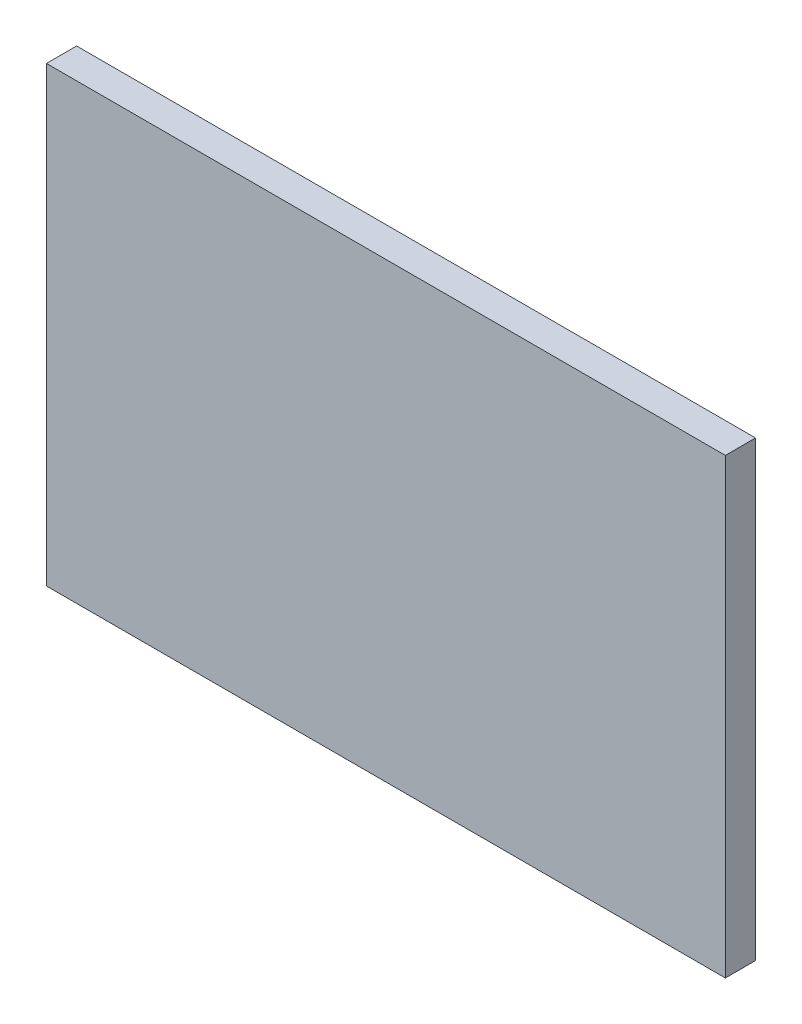
ISO-10303-21;
HEADER;
FILE_DESCRIPTION(('STEP AP214'),'2;1');
FILE_NAME('part.step','',(''),(''),'','','');
FILE_SCHEMA(('AUTOMOTIVE_DESIGN { 1 0 10303 214 1 1 1 1 }'));
ENDSEC;
DATA;
#1=APPLICATION_CONTEXT('core data for automotive mechanical design processes');
#2=APPLICATION_PROTOCOL_DEFINITION('international standard','automotive_design',2000,#1);
#3=PRODUCT_CONTEXT('',#1,'mechanical');
#4=PRODUCT('Part','Part','',(#3));
#5=PRODUCT_RELATED_PRODUCT_CATEGORY('part','',(#4));
#6=PRODUCT_DEFINITION_FORMATION('','',#4);
#7=PRODUCT_DEFINITION_CONTEXT('part definition',#1,'design');
#8=PRODUCT_DEFINITION('design','',#6,#7);
#9=PRODUCT_DEFINITION_SHAPE('','',#8);
#10=(LENGTH_UNIT() NAMED_UNIT(*) SI_UNIT(.MILLI.,.METRE.));
#11=(NAMED_UNIT(*) PLANE_ANGLE_UNIT() SI_UNIT($,.RADIAN.));
#12=(NAMED_UNIT(*) SI_UNIT($,.STERADIAN.) SOLID_ANGLE_UNIT());
#13=UNCERTAINTY_MEASURE_WITH_UNIT(LENGTH_MEASURE(1.E-05),#10,'distance_accuracy_value','');
#14=(GEOMETRIC_REPRESENTATION_CONTEXT(3) GLOBAL_UNCERTAINTY_ASSIGNED_CONTEXT((#13)) GLOBAL_UNIT_ASSIGNED_CONTEXT((#10,
#11,#12)) REPRESENTATION_CONTEXT('',''));
#15=CARTESIAN_POINT('',(0.,0.,0.));
#16=DIRECTION('',(0.,0.,1.));
#17=DIRECTION('',(1.,0.,0.));
#18=AXIS2_PLACEMENT_3D('',#15,#16,#17);
#19=CARTESIAN_POINT('',(0.,0.,0.));
#20=DIRECTION('',(0.,0.,1.));
#21=DIRECTION('',(1.,0.,0.));
#22=AXIS2_PLACEMENT_3D('',#19,#20,#21);
#23=PLANE('',#22);
#24=DIRECTION('',(0.,-1.,0.));
#25=VECTOR('',#24,1.);
#26=CARTESIAN_POINT('',(-22.5,-15.,0.));
#27=LINE('',#26,#25);
#28=CARTESIAN_POINT('',(-22.5,15.,0.));
#29=VERTEX_POINT('',#28);
#30=CARTESIAN_POINT('',(-22.5,-15.,0.));
#31=VERTEX_POINT('',#30);
#32=EDGE_CURVE('E191',#29,#31,#27,.T.);
#33=ORIENTED_EDGE('',*,*,#32,.F.);
#34=DIRECTION('',(-1.,0.,0.));
#35=VECTOR('',#34,1.);
#36=CARTESIAN_POINT('',(22.5,15.,0.));
#37=LINE('',#36,#35);
#38=CARTESIAN_POINT('',(22.5,15.,0.));
#39=VERTEX_POINT('',#38);
#40=EDGE_CURVE('E196',#39,#29,#37,.T.);
#41=ORIENTED_EDGE('',*,*,#40,.F.);
#42=DIRECTION('',(0.,1.,0.));
#43=VECTOR('',#42,1.);
#44=CARTESIAN_POINT('',(22.5,-15.,0.));
#45=LINE('',#44,#43);
#46=CARTESIAN_POINT('',(22.5,-15.,0.));
#47=VERTEX_POINT('',#46);
#48=EDGE_CURVE('E207',#47,#39,#45,.T.);
#49=ORIENTED_EDGE('',*,*,#48,.F.);
#50=DIRECTION('',(1.,0.,0.));
#51=VECTOR('',#50,1.);
#52=CARTESIAN_POINT('',(22.5,-15.,0.));
#53=LINE('',#52,#51);
#54=EDGE_CURVE('E205',#31,#47,#53,.T.);
#55=ORIENTED_EDGE('',*,*,#54,.F.);
#56=EDGE_LOOP('',(#33,#41,#49,#55));
#57=FACE_BOUND('',#56,.T.);
#58=DIRECTION('',(0.,-1.,0.));
#59=VECTOR('',#58,1.);
#60=CARTESIAN_POINT('',(20.5,-13.,0.));
#61=LINE('',#60,#59);
#62=CARTESIAN_POINT('',(20.5,13.,0.));
#63=VERTEX_POINT('',#62);
#64=CARTESIAN_POINT('',(20.5,-13.,0.));
#65=VERTEX_POINT('',#64);
#66=EDGE_CURVE('E172',#63,#65,#61,.T.);
#67=ORIENTED_EDGE('',*,*,#66,.F.);
#68=DIRECTION('',(1.,0.,0.));
#69=VECTOR('',#68,1.);
#70=CARTESIAN_POINT('',(-20.5,13.,0.));
#71=LINE('',#70,#69);
#72=CARTESIAN_POINT('',(-20.5,13.,0.));
#73=VERTEX_POINT('',#72);
#74=EDGE_CURVE('E165',#73,#63,#71,.T.);
#75=ORIENTED_EDGE('',*,*,#74,.F.);
#76=DIRECTION('',(0.,1.,0.));
#77=VECTOR('',#76,1.);
#78=CARTESIAN_POINT('',(-20.5,-13.,0.));
#79=LINE('',#78,#77);
#80=CARTESIAN_POINT('',(-20.5,-13.,0.));
#81=VERTEX_POINT('',#80);
#82=EDGE_CURVE('E176',#81,#73,#79,.T.);
#83=ORIENTED_EDGE('',*,*,#82,.F.);
#84=DIRECTION('',(-1.,0.,0.));
#85=VECTOR('',#84,1.);
#86=CARTESIAN_POINT('',(-20.5,-13.,0.));
#87=LINE('',#86,#85);
#88=EDGE_CURVE('E59',#65,#81,#87,.T.);
#89=ORIENTED_EDGE('',*,*,#88,.F.);
#90=EDGE_LOOP('',(#67,#75,#83,#89));
#91=FACE_BOUND('',#90,.T.);
#92=ADVANCED_FACE('F36',(#57,#91),#23,.F.);
#93=CARTESIAN_POINT('',(-22.5,-15.,2.));
#94=DIRECTION('',(1.,0.,0.));
#95=DIRECTION('',(0.,1.,0.));
#96=AXIS2_PLACEMENT_3D('',#93,#94,#95);
#97=PLANE('',#96);
#98=ORIENTED_EDGE('',*,*,#32,.T.);
#99=DIRECTION('',(0.,0.,-1.));
#100=VECTOR('',#99,1.);
#101=CARTESIAN_POINT('',(-22.5,-15.,2.));
#102=LINE('',#101,#100);
#103=CARTESIAN_POINT('',(-22.5,-15.,2.));
#104=VERTEX_POINT('',#103);
#105=EDGE_CURVE('E11',#104,#31,#102,.T.);
#106=ORIENTED_EDGE('',*,*,#105,.F.);
#107=DIRECTION('',(0.,-1.,0.));
#108=VECTOR('',#107,1.);
#109=CARTESIAN_POINT('',(-22.5,-15.,2.));
#110=LINE('',#109,#108);
#111=CARTESIAN_POINT('',(-22.5,15.,2.));
#112=VERTEX_POINT('',#111);
#113=EDGE_CURVE('E192',#112,#104,#110,.T.);
#114=ORIENTED_EDGE('',*,*,#113,.F.);
#115=DIRECTION('',(0.,0.,-1.));
#116=VECTOR('',#115,1.);
#117=CARTESIAN_POINT('',(-22.5,15.,2.));
#118=LINE('',#117,#116);
#119=EDGE_CURVE('E202',#112,#29,#118,.T.);
#120=ORIENTED_EDGE('',*,*,#119,.T.);
#121=EDGE_LOOP('',(#98,#106,#114,#120));
#122=FACE_BOUND('',#121,.T.);
#123=ADVANCED_FACE('F38',(#122),#97,.F.);
#124=CARTESIAN_POINT('',(22.5,-15.,2.));
#125=DIRECTION('',(0.,1.,0.));
#126=DIRECTION('',(-1.,0.,0.));
#127=AXIS2_PLACEMENT_3D('',#124,#125,#126);
#128=PLANE('',#127);
#129=ORIENTED_EDGE('',*,*,#54,.T.);
#130=DIRECTION('',(0.,0.,-1.));
#131=VECTOR('',#130,1.);
#132=CARTESIAN_POINT('',(22.5,-15.,2.));
#133=LINE('',#132,#131);
#134=CARTESIAN_POINT('',(22.5,-15.,2.));
#135=VERTEX_POINT('',#134);
#136=EDGE_CURVE('E44',#135,#47,#133,.T.);
#137=ORIENTED_EDGE('',*,*,#136,.F.);
#138=DIRECTION('',(1.,0.,0.));
#139=VECTOR('',#138,1.);
#140=CARTESIAN_POINT('',(22.5,-15.,2.));
#141=LINE('',#140,#139);
#142=EDGE_CURVE('E195',#104,#135,#141,.T.);
#143=ORIENTED_EDGE('',*,*,#142,.F.);
#144=ORIENTED_EDGE('',*,*,#105,.T.);
#145=EDGE_LOOP('',(#129,#137,#143,#144));
#146=FACE_BOUND('',#145,.T.);
#147=ADVANCED_FACE('F234',(#146),#128,.F.);
#148=CARTESIAN_POINT('',(22.5,-15.,2.));
#149=DIRECTION('',(-1.,0.,0.));
#150=DIRECTION('',(0.,0.,1.));
#151=AXIS2_PLACEMENT_3D('',#148,#149,#150);
#152=PLANE('',#151);
#153=ORIENTED_EDGE('',*,*,#48,.T.);
#154=DIRECTION('',(0.,0.,-1.));
#155=VECTOR('',#154,1.);
#156=CARTESIAN_POINT('',(22.5,15.,2.));
#157=LINE('',#156,#155);
#158=CARTESIAN_POINT('',(22.5,15.,2.));
#159=VERTEX_POINT('',#158);
#160=EDGE_CURVE('E212',#159,#39,#157,.T.);
#161=ORIENTED_EDGE('',*,*,#160,.F.);
#162=DIRECTION('',(0.,1.,0.));
#163=VECTOR('',#162,1.);
#164=CARTESIAN_POINT('',(22.5,-15.,2.));
#165=LINE('',#164,#163);
#166=EDGE_CURVE('E198',#135,#159,#165,.T.);
#167=ORIENTED_EDGE('',*,*,#166,.F.);
#168=ORIENTED_EDGE('',*,*,#136,.T.);
#169=EDGE_LOOP('',(#153,#161,#167,#168));
#170=FACE_BOUND('',#169,.T.);
#171=ADVANCED_FACE('F219',(#170),#152,.F.);
#172=CARTESIAN_POINT('',(22.5,15.,2.));
#173=DIRECTION('',(0.,-1.,0.));
#174=DIRECTION('',(1.,0.,0.));
#175=AXIS2_PLACEMENT_3D('',#172,#173,#174);
#176=PLANE('',#175);
#177=ORIENTED_EDGE('',*,*,#40,.T.);
#178=ORIENTED_EDGE('',*,*,#119,.F.);
#179=DIRECTION('',(-1.,0.,0.));
#180=VECTOR('',#179,1.);
#181=CARTESIAN_POINT('',(22.5,15.,2.));
#182=LINE('',#181,#180);
#183=EDGE_CURVE('E200',#159,#112,#182,.T.);
#184=ORIENTED_EDGE('',*,*,#183,.F.);
#185=ORIENTED_EDGE('',*,*,#160,.T.);
#186=EDGE_LOOP('',(#177,#178,#184,#185));
#187=FACE_BOUND('',#186,.T.);
#188=ADVANCED_FACE('F227',(#187),#176,.F.);
#189=CARTESIAN_POINT('',(0.,0.,2.));
#190=DIRECTION('',(0.,0.,1.));
#191=DIRECTION('',(1.,0.,0.));
#192=AXIS2_PLACEMENT_3D('',#189,#190,#191);
#193=PLANE('',#192);
#194=ORIENTED_EDGE('',*,*,#113,.T.);
#195=ORIENTED_EDGE('',*,*,#142,.T.);
#196=ORIENTED_EDGE('',*,*,#166,.T.);
#197=ORIENTED_EDGE('',*,*,#183,.T.);
#198=EDGE_LOOP('',(#194,#195,#196,#197));
#199=FACE_BOUND('',#198,.T.);
#200=ADVANCED_FACE('F233',(#199),#193,.T.);
#201=CARTESIAN_POINT('',(20.5,-13.,-2.));
#202=DIRECTION('',(-1.,0.,0.));
#203=DIRECTION('',(0.,0.,1.));
#204=AXIS2_PLACEMENT_3D('',#201,#202,#203);
#205=PLANE('',#204);
#206=ORIENTED_EDGE('',*,*,#66,.T.);
#207=DIRECTION('',(0.,0.,1.));
#208=VECTOR('',#207,1.);
#209=CARTESIAN_POINT('',(20.5,-13.,-2.));
#210=LINE('',#209,#208);
#211=CARTESIAN_POINT('',(20.5,-13.,-2.));
#212=VERTEX_POINT('',#211);
#213=EDGE_CURVE('E189',#212,#65,#210,.T.);
#214=ORIENTED_EDGE('',*,*,#213,.F.);
#215=DIRECTION('',(0.,-1.,0.));
#216=VECTOR('',#215,1.);
#217=CARTESIAN_POINT('',(20.5,-13.,-2.));
#218=LINE('',#217,#216);
#219=CARTESIAN_POINT('',(20.5,13.,-2.));
#220=VERTEX_POINT('',#219);
#221=EDGE_CURVE('E161',#220,#212,#218,.T.);
#222=ORIENTED_EDGE('',*,*,#221,.F.);
#223=DIRECTION('',(0.,0.,1.));
#224=VECTOR('',#223,1.);
#225=CARTESIAN_POINT('',(20.5,13.,-2.));
#226=LINE('',#225,#224);
#227=EDGE_CURVE('E171',#220,#63,#226,.T.);
#228=ORIENTED_EDGE('',*,*,#227,.T.);
#229=EDGE_LOOP('',(#206,#214,#222,#228));
#230=FACE_BOUND('',#229,.T.);
#231=ADVANCED_FACE('F252',(#230),#205,.F.);
#232=CARTESIAN_POINT('',(-20.5,-13.,-2.));
#233=DIRECTION('',(0.,1.,0.));
#234=DIRECTION('',(0.,0.,1.));
#235=AXIS2_PLACEMENT_3D('',#232,#233,#234);
#236=PLANE('',#235);
#237=ORIENTED_EDGE('',*,*,#88,.T.);
#238=DIRECTION('',(0.,0.,1.));
#239=VECTOR('',#238,1.);
#240=CARTESIAN_POINT('',(-20.5,-13.,-2.));
#241=LINE('',#240,#239);
#242=CARTESIAN_POINT('',(-20.5,-13.,-2.));
#243=VERTEX_POINT('',#242);
#244=EDGE_CURVE('E186',#243,#81,#241,.T.);
#245=ORIENTED_EDGE('',*,*,#244,.F.);
#246=DIRECTION('',(-1.,0.,0.));
#247=VECTOR('',#246,1.);
#248=CARTESIAN_POINT('',(-20.5,-13.,-2.));
#249=LINE('',#248,#247);
#250=EDGE_CURVE('E164',#212,#243,#249,.T.);
#251=ORIENTED_EDGE('',*,*,#250,.F.);
#252=ORIENTED_EDGE('',*,*,#213,.T.);
#253=EDGE_LOOP('',(#237,#245,#251,#252));
#254=FACE_BOUND('',#253,.T.);
#255=ADVANCED_FACE('F256',(#254),#236,.F.);
#256=CARTESIAN_POINT('',(-20.5,-13.,-2.));
#257=DIRECTION('',(1.,0.,0.));
#258=DIRECTION('',(0.,0.,-1.));
#259=AXIS2_PLACEMENT_3D('',#256,#257,#258);
#260=PLANE('',#259);
#261=ORIENTED_EDGE('',*,*,#82,.T.);
#262=DIRECTION('',(0.,0.,1.));
#263=VECTOR('',#262,1.);
#264=CARTESIAN_POINT('',(-20.5,13.,-2.));
#265=LINE('',#264,#263);
#266=CARTESIAN_POINT('',(-20.5,13.,-2.));
#267=VERTEX_POINT('',#266);
#268=EDGE_CURVE('E183',#267,#73,#265,.T.);
#269=ORIENTED_EDGE('',*,*,#268,.F.);
#270=DIRECTION('',(0.,1.,0.));
#271=VECTOR('',#270,1.);
#272=CARTESIAN_POINT('',(-20.5,-13.,-2.));
#273=LINE('',#272,#271);
#274=EDGE_CURVE('E167',#243,#267,#273,.T.);
#275=ORIENTED_EDGE('',*,*,#274,.F.);
#276=ORIENTED_EDGE('',*,*,#244,.T.);
#277=EDGE_LOOP('',(#261,#269,#275,#276));
#278=FACE_BOUND('',#277,.T.);
#279=ADVANCED_FACE('F261',(#278),#260,.F.);
#280=CARTESIAN_POINT('',(-20.5,13.,-2.));
#281=DIRECTION('',(0.,-1.,0.));
#282=DIRECTION('',(0.,0.,-1.));
#283=AXIS2_PLACEMENT_3D('',#280,#281,#282);
#284=PLANE('',#283);
#285=ORIENTED_EDGE('',*,*,#74,.T.);
#286=ORIENTED_EDGE('',*,*,#227,.F.);
#287=DIRECTION('',(1.,0.,0.));
#288=VECTOR('',#287,1.);
#289=CARTESIAN_POINT('',(-20.5,13.,-2.));
#290=LINE('',#289,#288);
#291=EDGE_CURVE('E169',#267,#220,#290,.T.);
#292=ORIENTED_EDGE('',*,*,#291,.F.);
#293=ORIENTED_EDGE('',*,*,#268,.T.);
#294=EDGE_LOOP('',(#285,#286,#292,#293));
#295=FACE_BOUND('',#294,.T.);
#296=ADVANCED_FACE('F267',(#295),#284,.F.);
#297=CARTESIAN_POINT('',(0.,0.,-2.));
#298=DIRECTION('',(0.,0.,-1.));
#299=DIRECTION('',(-1.,0.,0.));
#300=AXIS2_PLACEMENT_3D('',#297,#298,#299);
#301=PLANE('',#300);
#302=DIRECTION('',(0.,-1.,0.));
#303=VECTOR('',#302,1.);
#304=CARTESIAN_POINT('',(19.5,-13.,-2.));
#305=LINE('',#304,#303);
#306=CARTESIAN_POINT('',(19.5,12.,-2.));
#307=VERTEX_POINT('',#306);
#308=CARTESIAN_POINT('',(19.5,-12.,-2.));
#309=VERTEX_POINT('',#308);
#310=EDGE_CURVE('E133',#307,#309,#305,.T.);
#311=ORIENTED_EDGE('',*,*,#310,.F.);
#312=DIRECTION('',(1.,0.,0.));
#313=VECTOR('',#312,1.);
#314=CARTESIAN_POINT('',(-20.5,12.,-2.));
#315=LINE('',#314,#313);
#316=CARTESIAN_POINT('',(-19.5,12.,-2.));
#317=VERTEX_POINT('',#316);
#318=EDGE_CURVE('E146',#317,#307,#315,.T.);
#319=ORIENTED_EDGE('',*,*,#318,.F.);
#320=DIRECTION('',(0.,1.,0.));
#321=VECTOR('',#320,1.);
#322=CARTESIAN_POINT('',(-19.5,-13.,-2.));
#323=LINE('',#322,#321);
#324=CARTESIAN_POINT('',(-19.5,-12.,-2.));
#325=VERTEX_POINT('',#324);
#326=EDGE_CURVE('E150',#325,#317,#323,.T.);
#327=ORIENTED_EDGE('',*,*,#326,.F.);
#328=DIRECTION('',(-1.,0.,0.));
#329=VECTOR('',#328,1.);
#330=CARTESIAN_POINT('',(-20.5,-12.,-2.));
#331=LINE('',#330,#329);
#332=EDGE_CURVE('E158',#309,#325,#331,.T.);
#333=ORIENTED_EDGE('',*,*,#332,.F.);
#334=EDGE_LOOP('',(#311,#319,#327,#333));
#335=FACE_BOUND('',#334,.T.);
#336=ORIENTED_EDGE('',*,*,#221,.T.);
#337=ORIENTED_EDGE('',*,*,#250,.T.);
#338=ORIENTED_EDGE('',*,*,#274,.T.);
#339=ORIENTED_EDGE('',*,*,#291,.T.);
#340=EDGE_LOOP('',(#336,#337,#338,#339));
#341=FACE_BOUND('',#340,.T.);
#342=ADVANCED_FACE('F271',(#335,#341),#301,.T.);
#343=CARTESIAN_POINT('',(0.,0.,1.));
#344=DIRECTION('',(0.,0.,1.));
#345=DIRECTION('',(1.,0.,0.));
#346=AXIS2_PLACEMENT_3D('',#343,#344,#345);
#347=PLANE('',#346);
#348=DIRECTION('',(0.,1.,0.));
#349=VECTOR('',#348,1.);
#350=CARTESIAN_POINT('',(-19.5,0.,1.));
#351=LINE('',#350,#349);
#352=CARTESIAN_POINT('',(-19.5,-12.,1.));
#353=VERTEX_POINT('',#352);
#354=CARTESIAN_POINT('',(-19.5,12.,1.));
#355=VERTEX_POINT('',#354);
#356=EDGE_CURVE('E131',#353,#355,#351,.T.);
#357=ORIENTED_EDGE('',*,*,#356,.T.);
#358=DIRECTION('',(1.,0.,0.));
#359=VECTOR('',#358,1.);
#360=CARTESIAN_POINT('',(0.,12.,1.));
#361=LINE('',#360,#359);
#362=CARTESIAN_POINT('',(19.5,12.,1.));
#363=VERTEX_POINT('',#362);
#364=EDGE_CURVE('E125',#355,#363,#361,.T.);
#365=ORIENTED_EDGE('',*,*,#364,.T.);
#366=DIRECTION('',(0.,-1.,0.));
#367=VECTOR('',#366,1.);
#368=CARTESIAN_POINT('',(19.5,0.,1.));
#369=LINE('',#368,#367);
#370=CARTESIAN_POINT('',(19.5,-12.,1.));
#371=VERTEX_POINT('',#370);
#372=EDGE_CURVE('E128',#363,#371,#369,.T.);
#373=ORIENTED_EDGE('',*,*,#372,.T.);
#374=DIRECTION('',(-1.,0.,0.));
#375=VECTOR('',#374,1.);
#376=CARTESIAN_POINT('',(0.,-12.,1.));
#377=LINE('',#376,#375);
#378=EDGE_CURVE('E142',#371,#353,#377,.T.);
#379=ORIENTED_EDGE('',*,*,#378,.T.);
#380=EDGE_LOOP('',(#357,#365,#373,#379));
#381=FACE_BOUND('',#380,.T.);
#382=ADVANCED_FACE('F127',(#381),#347,.F.);
#383=CARTESIAN_POINT('',(19.5,-13.,-2.));
#384=DIRECTION('',(-1.,0.,0.));
#385=DIRECTION('',(0.,0.,1.));
#386=AXIS2_PLACEMENT_3D('',#383,#384,#385);
#387=PLANE('',#386);
#388=ORIENTED_EDGE('',*,*,#372,.F.);
#389=DIRECTION('',(0.,0.,1.));
#390=VECTOR('',#389,1.);
#391=CARTESIAN_POINT('',(19.5,12.,-2.));
#392=LINE('',#391,#390);
#393=EDGE_CURVE('E138',#307,#363,#392,.T.);
#394=ORIENTED_EDGE('',*,*,#393,.F.);
#395=ORIENTED_EDGE('',*,*,#310,.T.);
#396=DIRECTION('',(0.,0.,1.));
#397=VECTOR('',#396,1.);
#398=CARTESIAN_POINT('',(19.5,-12.,-2.));
#399=LINE('',#398,#397);
#400=EDGE_CURVE('E141',#309,#371,#399,.T.);
#401=ORIENTED_EDGE('',*,*,#400,.T.);
#402=EDGE_LOOP('',(#388,#394,#395,#401));
#403=FACE_BOUND('',#402,.T.);
#404=ADVANCED_FACE('F137',(#403),#387,.T.);
#405=CARTESIAN_POINT('',(-20.5,-12.,-2.));
#406=DIRECTION('',(0.,1.,0.));
#407=DIRECTION('',(0.,0.,1.));
#408=AXIS2_PLACEMENT_3D('',#405,#406,#407);
#409=PLANE('',#408);
#410=ORIENTED_EDGE('',*,*,#378,.F.);
#411=ORIENTED_EDGE('',*,*,#400,.F.);
#412=ORIENTED_EDGE('',*,*,#332,.T.);
#413=DIRECTION('',(0.,0.,1.));
#414=VECTOR('',#413,1.);
#415=CARTESIAN_POINT('',(-19.5,-12.,-2.));
#416=LINE('',#415,#414);
#417=EDGE_CURVE('E148',#325,#353,#416,.T.);
#418=ORIENTED_EDGE('',*,*,#417,.T.);
#419=EDGE_LOOP('',(#410,#411,#412,#418));
#420=FACE_BOUND('',#419,.T.);
#421=ADVANCED_FACE('F281',(#420),#409,.T.);
#422=CARTESIAN_POINT('',(-19.5,-13.,-2.));
#423=DIRECTION('',(1.,0.,0.));
#424=DIRECTION('',(0.,0.,-1.));
#425=AXIS2_PLACEMENT_3D('',#422,#423,#424);
#426=PLANE('',#425);
#427=ORIENTED_EDGE('',*,*,#356,.F.);
#428=ORIENTED_EDGE('',*,*,#417,.F.);
#429=ORIENTED_EDGE('',*,*,#326,.T.);
#430=DIRECTION('',(0.,0.,1.));
#431=VECTOR('',#430,1.);
#432=CARTESIAN_POINT('',(-19.5,12.,-2.));
#433=LINE('',#432,#431);
#434=EDGE_CURVE('E51',#317,#355,#433,.T.);
#435=ORIENTED_EDGE('',*,*,#434,.T.);
#436=EDGE_LOOP('',(#427,#428,#429,#435));
#437=FACE_BOUND('',#436,.T.);
#438=ADVANCED_FACE('F278',(#437),#426,.T.);
#439=CARTESIAN_POINT('',(-20.5,12.,-2.));
#440=DIRECTION('',(0.,-1.,0.));
#441=DIRECTION('',(0.,0.,-1.));
#442=AXIS2_PLACEMENT_3D('',#439,#440,#441);
#443=PLANE('',#442);
#444=ORIENTED_EDGE('',*,*,#364,.F.);
#445=ORIENTED_EDGE('',*,*,#434,.F.);
#446=ORIENTED_EDGE('',*,*,#318,.T.);
#447=ORIENTED_EDGE('',*,*,#393,.T.);
#448=EDGE_LOOP('',(#444,#445,#446,#447));
#449=FACE_BOUND('',#448,.T.);
#450=ADVANCED_FACE('F144',(#449),#443,.T.);
#451=CLOSED_SHELL('',(#92,#123,#147,#171,#188,#200,#231,#255,#279,#296,#342,#382,#404,#421,#438,#450));
#452=MANIFOLD_SOLID_BREP('B2',#451);
#453=ADVANCED_BREP_SHAPE_REPRESENTATION('',(#18,#452),#14);
#454=SHAPE_DEFINITION_REPRESENTATION(#9,#453);
ENDSEC;
END-ISO-10303-21;
